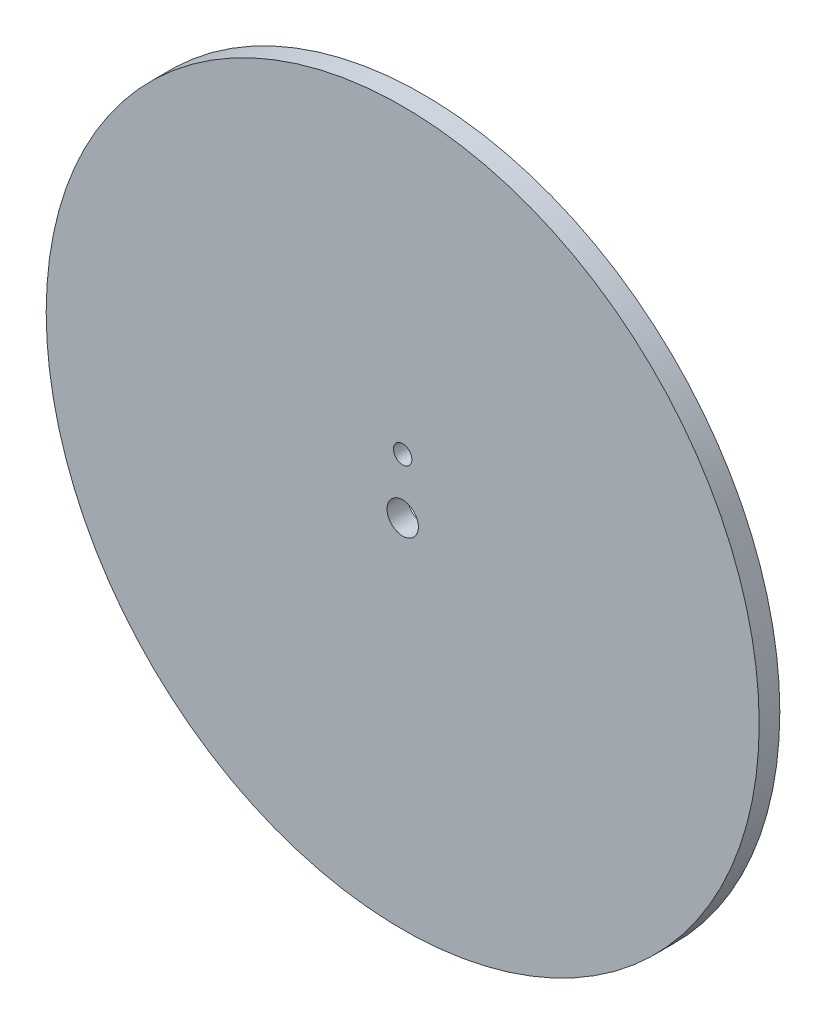
ISO-10303-21;
HEADER;
FILE_DESCRIPTION(('STEP AP214'),'2;1');
FILE_NAME('part.step','',(''),(''),'','','');
FILE_SCHEMA(('AUTOMOTIVE_DESIGN { 1 0 10303 214 1 1 1 1 }'));
ENDSEC;
DATA;
#1=APPLICATION_CONTEXT('core data for automotive mechanical design processes');
#2=APPLICATION_PROTOCOL_DEFINITION('international standard','automotive_design',2000,#1);
#3=PRODUCT_CONTEXT('',#1,'mechanical');
#4=PRODUCT('Part','Part','',(#3));
#5=PRODUCT_RELATED_PRODUCT_CATEGORY('part','',(#4));
#6=PRODUCT_DEFINITION_FORMATION('','',#4);
#7=PRODUCT_DEFINITION_CONTEXT('part definition',#1,'design');
#8=PRODUCT_DEFINITION('design','',#6,#7);
#9=PRODUCT_DEFINITION_SHAPE('','',#8);
#10=(LENGTH_UNIT() NAMED_UNIT(*) SI_UNIT(.MILLI.,.METRE.));
#11=(NAMED_UNIT(*) PLANE_ANGLE_UNIT() SI_UNIT($,.RADIAN.));
#12=(NAMED_UNIT(*) SI_UNIT($,.STERADIAN.) SOLID_ANGLE_UNIT());
#13=UNCERTAINTY_MEASURE_WITH_UNIT(LENGTH_MEASURE(1.E-05),#10,'distance_accuracy_value','');
#14=(GEOMETRIC_REPRESENTATION_CONTEXT(3) GLOBAL_UNCERTAINTY_ASSIGNED_CONTEXT((#13)) GLOBAL_UNIT_ASSIGNED_CONTEXT((#10,
#11,#12)) REPRESENTATION_CONTEXT('',''));
#15=CARTESIAN_POINT('',(0.,0.,0.));
#16=DIRECTION('',(0.,0.,1.));
#17=DIRECTION('',(1.,0.,0.));
#18=AXIS2_PLACEMENT_3D('',#15,#16,#17);
#19=CARTESIAN_POINT('',(0.,0.,3.175));
#20=DIRECTION('',(0.,0.,1.));
#21=DIRECTION('',(1.,0.,0.));
#22=AXIS2_PLACEMENT_3D('',#19,#20,#21);
#23=PLANE('',#22);
#24=CARTESIAN_POINT('',(0.,0.,3.175));
#25=DIRECTION('',(0.,0.,1.));
#26=DIRECTION('',(1.,0.,0.));
#27=AXIS2_PLACEMENT_3D('',#24,#25,#26);
#28=CIRCLE('',#27,2.415);
#29=CARTESIAN_POINT('',(2.415,0.,3.175));
#30=VERTEX_POINT('',#29);
#31=EDGE_CURVE('E43',#30,#30,#28,.T.);
#32=ORIENTED_EDGE('',*,*,#31,.F.);
#33=EDGE_LOOP('',(#32));
#34=FACE_BOUND('',#33,.T.);
#35=CARTESIAN_POINT('',(0.,0.,3.175));
#36=DIRECTION('',(0.,0.,1.));
#37=DIRECTION('',(1.,0.,0.));
#38=AXIS2_PLACEMENT_3D('',#35,#36,#37);
#39=CIRCLE('',#38,54.915);
#40=CARTESIAN_POINT('',(54.915,0.,3.175));
#41=VERTEX_POINT('',#40);
#42=EDGE_CURVE('E10',#41,#41,#39,.T.);
#43=ORIENTED_EDGE('',*,*,#42,.T.);
#44=EDGE_LOOP('',(#43));
#45=FACE_BOUND('',#44,.T.);
#46=CARTESIAN_POINT('',(0.,8.5,3.175));
#47=DIRECTION('',(0.,0.,1.));
#48=DIRECTION('',(1.,0.,0.));
#49=AXIS2_PLACEMENT_3D('',#46,#47,#48);
#50=CIRCLE('',#49,1.415);
#51=CARTESIAN_POINT('',(1.415,8.5,3.175));
#52=VERTEX_POINT('',#51);
#53=EDGE_CURVE('E48',#52,#52,#50,.T.);
#54=ORIENTED_EDGE('',*,*,#53,.F.);
#55=EDGE_LOOP('',(#54));
#56=FACE_BOUND('',#55,.T.);
#57=ADVANCED_FACE('F32',(#34,#45,#56),#23,.T.);
#58=CARTESIAN_POINT('',(0.,0.,0.));
#59=DIRECTION('',(0.,0.,1.));
#60=DIRECTION('',(1.,0.,0.));
#61=AXIS2_PLACEMENT_3D('',#58,#59,#60);
#62=PLANE('',#61);
#63=CARTESIAN_POINT('',(0.,0.,0.));
#64=DIRECTION('',(0.,0.,1.));
#65=DIRECTION('',(1.,0.,0.));
#66=AXIS2_PLACEMENT_3D('',#63,#64,#65);
#67=CIRCLE('',#66,54.915);
#68=CARTESIAN_POINT('',(54.915,0.,0.));
#69=VERTEX_POINT('',#68);
#70=EDGE_CURVE('E36',#69,#69,#67,.T.);
#71=ORIENTED_EDGE('',*,*,#70,.F.);
#72=EDGE_LOOP('',(#71));
#73=FACE_BOUND('',#72,.T.);
#74=CARTESIAN_POINT('',(0.,0.,0.));
#75=DIRECTION('',(0.,0.,1.));
#76=DIRECTION('',(1.,0.,0.));
#77=AXIS2_PLACEMENT_3D('',#74,#75,#76);
#78=CIRCLE('',#77,2.415);
#79=CARTESIAN_POINT('',(2.415,0.,0.));
#80=VERTEX_POINT('',#79);
#81=EDGE_CURVE('E45',#80,#80,#78,.T.);
#82=ORIENTED_EDGE('',*,*,#81,.T.);
#83=EDGE_LOOP('',(#82));
#84=FACE_BOUND('',#83,.T.);
#85=CARTESIAN_POINT('',(0.,8.5,0.));
#86=DIRECTION('',(0.,0.,1.));
#87=DIRECTION('',(1.,0.,0.));
#88=AXIS2_PLACEMENT_3D('',#85,#86,#87);
#89=CIRCLE('',#88,1.415);
#90=CARTESIAN_POINT('',(1.415,8.5,0.));
#91=VERTEX_POINT('',#90);
#92=EDGE_CURVE('E51',#91,#91,#89,.T.);
#93=ORIENTED_EDGE('',*,*,#92,.T.);
#94=EDGE_LOOP('',(#93));
#95=FACE_BOUND('',#94,.T.);
#96=ADVANCED_FACE('F61',(#73,#84,#95),#62,.F.);
#97=CARTESIAN_POINT('',(0.,0.,3.175));
#98=DIRECTION('',(0.,0.,-1.));
#99=DIRECTION('',(-1.,0.,0.));
#100=AXIS2_PLACEMENT_3D('',#97,#98,#99);
#101=CYLINDRICAL_SURFACE('',#100,54.915);
#102=ORIENTED_EDGE('',*,*,#42,.F.);
#103=EDGE_LOOP('',(#102));
#104=FACE_BOUND('',#103,.T.);
#105=ORIENTED_EDGE('',*,*,#70,.T.);
#106=EDGE_LOOP('',(#105));
#107=FACE_BOUND('',#106,.T.);
#108=ADVANCED_FACE('F34',(#104,#107),#101,.T.);
#109=CARTESIAN_POINT('',(0.,0.,3.175));
#110=DIRECTION('',(0.,0.,-1.));
#111=DIRECTION('',(-1.,0.,0.));
#112=AXIS2_PLACEMENT_3D('',#109,#110,#111);
#113=CYLINDRICAL_SURFACE('',#112,2.415);
#114=ORIENTED_EDGE('',*,*,#31,.T.);
#115=EDGE_LOOP('',(#114));
#116=FACE_BOUND('',#115,.T.);
#117=ORIENTED_EDGE('',*,*,#81,.F.);
#118=EDGE_LOOP('',(#117));
#119=FACE_BOUND('',#118,.T.);
#120=ADVANCED_FACE('F70',(#116,#119),#113,.F.);
#121=CARTESIAN_POINT('',(0.,8.5,3.175));
#122=DIRECTION('',(0.,0.,-1.));
#123=DIRECTION('',(-1.,0.,0.));
#124=AXIS2_PLACEMENT_3D('',#121,#122,#123);
#125=CYLINDRICAL_SURFACE('',#124,1.415);
#126=ORIENTED_EDGE('',*,*,#53,.T.);
#127=EDGE_LOOP('',(#126));
#128=FACE_BOUND('',#127,.T.);
#129=ORIENTED_EDGE('',*,*,#92,.F.);
#130=EDGE_LOOP('',(#129));
#131=FACE_BOUND('',#130,.T.);
#132=ADVANCED_FACE('F57',(#128,#131),#125,.F.);
#133=CLOSED_SHELL('',(#57,#96,#108,#120,#132));
#134=MANIFOLD_SOLID_BREP('B2',#133);
#135=ADVANCED_BREP_SHAPE_REPRESENTATION('',(#18,#134),#14);
#136=SHAPE_DEFINITION_REPRESENTATION(#9,#135);
ENDSEC;
END-ISO-10303-21;
